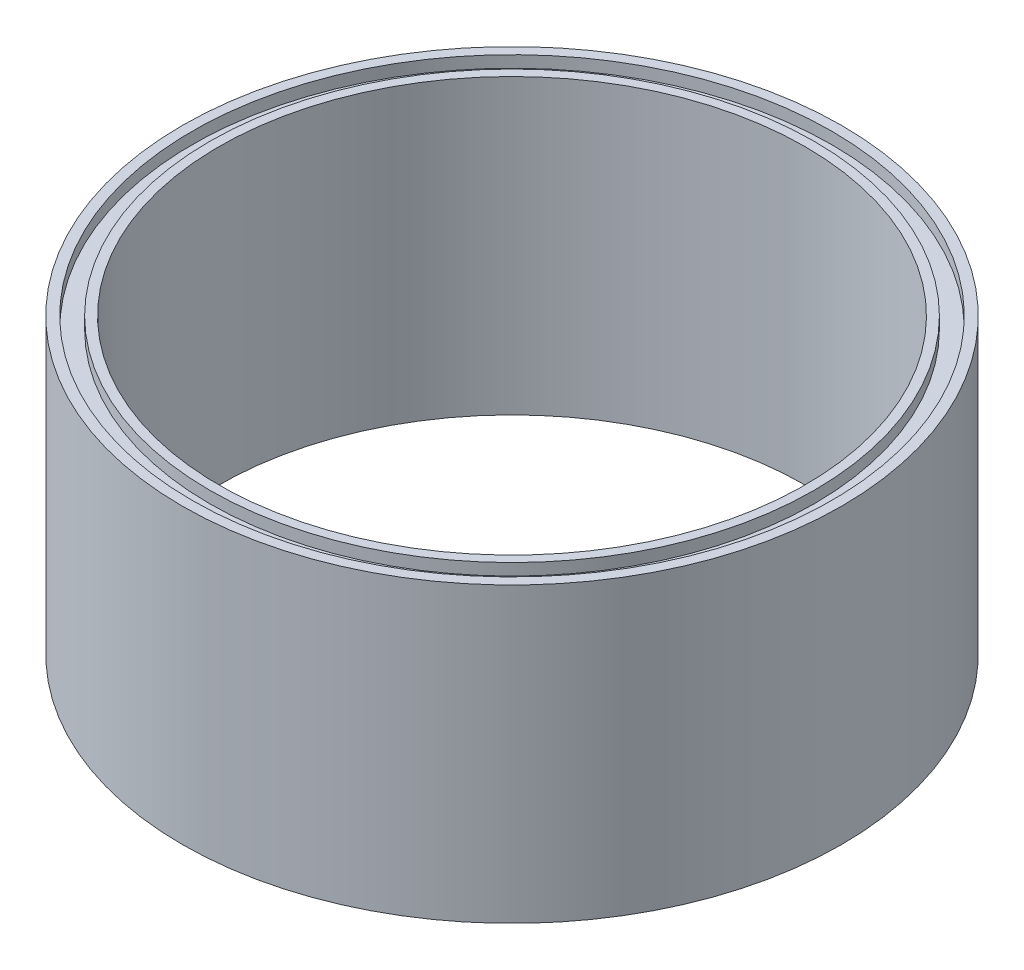
ISO-10303-21;
HEADER;
FILE_DESCRIPTION(('STEP AP214'),'2;1');
FILE_NAME('part.step','',(''),(''),'','','');
FILE_SCHEMA(('AUTOMOTIVE_DESIGN { 1 0 10303 214 1 1 1 1 }'));
ENDSEC;
DATA;
#1=APPLICATION_CONTEXT('core data for automotive mechanical design processes');
#2=APPLICATION_PROTOCOL_DEFINITION('international standard','automotive_design',2000,#1);
#3=PRODUCT_CONTEXT('',#1,'mechanical');
#4=PRODUCT('Part','Part','',(#3));
#5=PRODUCT_RELATED_PRODUCT_CATEGORY('part','',(#4));
#6=PRODUCT_DEFINITION_FORMATION('','',#4);
#7=PRODUCT_DEFINITION_CONTEXT('part definition',#1,'design');
#8=PRODUCT_DEFINITION('design','',#6,#7);
#9=PRODUCT_DEFINITION_SHAPE('','',#8);
#10=(LENGTH_UNIT() NAMED_UNIT(*) SI_UNIT(.MILLI.,.METRE.));
#11=(NAMED_UNIT(*) PLANE_ANGLE_UNIT() SI_UNIT($,.RADIAN.));
#12=(NAMED_UNIT(*) SI_UNIT($,.STERADIAN.) SOLID_ANGLE_UNIT());
#13=UNCERTAINTY_MEASURE_WITH_UNIT(LENGTH_MEASURE(1.E-05),#10,'distance_accuracy_value','');
#14=(GEOMETRIC_REPRESENTATION_CONTEXT(3) GLOBAL_UNCERTAINTY_ASSIGNED_CONTEXT((#13)) GLOBAL_UNIT_ASSIGNED_CONTEXT((#10,
#11,#12)) REPRESENTATION_CONTEXT('',''));
#15=CARTESIAN_POINT('',(0.,0.,0.));
#16=DIRECTION('',(0.,0.,1.));
#17=DIRECTION('',(1.,0.,0.));
#18=AXIS2_PLACEMENT_3D('',#15,#16,#17);
#19=CARTESIAN_POINT('',(-52.3875,0.,0.));
#20=DIRECTION('',(0.,1.,0.));
#21=DIRECTION('',(0.,0.,1.));
#22=AXIS2_PLACEMENT_3D('',#19,#20,#21);
#23=PLANE('',#22);
#24=CARTESIAN_POINT('',(0.,0.,0.));
#25=DIRECTION('',(0.,-1.,0.));
#26=DIRECTION('',(0.,0.,-1.));
#27=AXIS2_PLACEMENT_3D('',#24,#25,#26);
#28=CIRCLE('',#27,50.8);
#29=CARTESIAN_POINT('',(0.,0.,-50.8));
#30=VERTEX_POINT('',#29);
#31=EDGE_CURVE('E10',#30,#30,#28,.T.);
#32=ORIENTED_EDGE('',*,*,#31,.F.);
#33=EDGE_LOOP('',(#32));
#34=FACE_BOUND('',#33,.T.);
#35=CARTESIAN_POINT('',(0.,0.,0.));
#36=DIRECTION('',(0.,-1.,0.));
#37=DIRECTION('',(0.,0.,-1.));
#38=AXIS2_PLACEMENT_3D('',#35,#36,#37);
#39=CIRCLE('',#38,52.3875);
#40=CARTESIAN_POINT('',(0.,0.,-52.3875));
#41=VERTEX_POINT('',#40);
#42=EDGE_CURVE('E88',#41,#41,#39,.T.);
#43=ORIENTED_EDGE('',*,*,#42,.T.);
#44=EDGE_LOOP('',(#43));
#45=FACE_BOUND('',#44,.T.);
#46=ADVANCED_FACE('F37',(#34,#45),#23,.F.);
#47=CARTESIAN_POINT('',(0.,0.,0.));
#48=DIRECTION('',(0.,-1.,0.));
#49=DIRECTION('',(0.,0.,-1.));
#50=AXIS2_PLACEMENT_3D('',#47,#48,#49);
#51=CYLINDRICAL_SURFACE('',#50,50.8);
#52=CARTESIAN_POINT('',(0.,50.8,0.));
#53=DIRECTION('',(0.,-1.,0.));
#54=DIRECTION('',(0.,0.,-1.));
#55=AXIS2_PLACEMENT_3D('',#52,#53,#54);
#56=CIRCLE('',#55,50.8);
#57=CARTESIAN_POINT('',(0.,50.8,-50.8));
#58=VERTEX_POINT('',#57);
#59=EDGE_CURVE('E44',#58,#58,#56,.T.);
#60=ORIENTED_EDGE('',*,*,#59,.F.);
#61=EDGE_LOOP('',(#60));
#62=FACE_BOUND('',#61,.T.);
#63=ORIENTED_EDGE('',*,*,#31,.T.);
#64=EDGE_LOOP('',(#63));
#65=FACE_BOUND('',#64,.T.);
#66=ADVANCED_FACE('F150',(#62,#65),#51,.F.);
#67=CARTESIAN_POINT('',(-50.8,50.8,0.));
#68=DIRECTION('',(0.,-1.,0.));
#69=DIRECTION('',(0.,0.,-1.));
#70=AXIS2_PLACEMENT_3D('',#67,#68,#69);
#71=PLANE('',#70);
#72=CARTESIAN_POINT('',(0.,50.8,0.));
#73=DIRECTION('',(0.,-1.,0.));
#74=DIRECTION('',(0.,0.,-1.));
#75=AXIS2_PLACEMENT_3D('',#72,#73,#74);
#76=CIRCLE('',#75,52.3875);
#77=CARTESIAN_POINT('',(0.,50.8,-52.3875));
#78=VERTEX_POINT('',#77);
#79=EDGE_CURVE('E49',#78,#78,#76,.T.);
#80=ORIENTED_EDGE('',*,*,#79,.F.);
#81=EDGE_LOOP('',(#80));
#82=FACE_BOUND('',#81,.T.);
#83=ORIENTED_EDGE('',*,*,#59,.T.);
#84=EDGE_LOOP('',(#83));
#85=FACE_BOUND('',#84,.T.);
#86=ADVANCED_FACE('F145',(#82,#85),#71,.F.);
#87=CARTESIAN_POINT('',(0.,0.,0.));
#88=DIRECTION('',(0.,-1.,0.));
#89=DIRECTION('',(0.,0.,-1.));
#90=AXIS2_PLACEMENT_3D('',#87,#88,#89);
#91=CYLINDRICAL_SURFACE('',#90,52.3875);
#92=CARTESIAN_POINT('',(0.,48.768,0.));
#93=DIRECTION('',(0.,-1.,0.));
#94=DIRECTION('',(0.,0.,-1.));
#95=AXIS2_PLACEMENT_3D('',#92,#93,#94);
#96=CIRCLE('',#95,52.3875);
#97=CARTESIAN_POINT('',(0.,48.768,-52.3875));
#98=VERTEX_POINT('',#97);
#99=EDGE_CURVE('E54',#98,#98,#96,.T.);
#100=ORIENTED_EDGE('',*,*,#99,.F.);
#101=EDGE_LOOP('',(#100));
#102=FACE_BOUND('',#101,.T.);
#103=ORIENTED_EDGE('',*,*,#79,.T.);
#104=EDGE_LOOP('',(#103));
#105=FACE_BOUND('',#104,.T.);
#106=ADVANCED_FACE('F139',(#102,#105),#91,.T.);
#107=CARTESIAN_POINT('',(-52.3875,48.768,0.));
#108=DIRECTION('',(0.,-1.,0.));
#109=DIRECTION('',(0.,0.,-1.));
#110=AXIS2_PLACEMENT_3D('',#107,#108,#109);
#111=PLANE('',#110);
#112=CARTESIAN_POINT('',(0.,48.768,0.));
#113=DIRECTION('',(0.,-1.,0.));
#114=DIRECTION('',(0.,0.,-1.));
#115=AXIS2_PLACEMENT_3D('',#112,#113,#114);
#116=CIRCLE('',#115,55.4355);
#117=CARTESIAN_POINT('',(0.,48.768,-55.4355));
#118=VERTEX_POINT('',#117);
#119=EDGE_CURVE('E60',#118,#118,#116,.T.);
#120=ORIENTED_EDGE('',*,*,#119,.F.);
#121=EDGE_LOOP('',(#120));
#122=FACE_BOUND('',#121,.T.);
#123=ORIENTED_EDGE('',*,*,#99,.T.);
#124=EDGE_LOOP('',(#123));
#125=FACE_BOUND('',#124,.T.);
#126=ADVANCED_FACE('F133',(#122,#125),#111,.F.);
#127=CARTESIAN_POINT('',(0.,0.,0.));
#128=DIRECTION('',(0.,-1.,0.));
#129=DIRECTION('',(0.,0.,-1.));
#130=AXIS2_PLACEMENT_3D('',#127,#128,#129);
#131=CYLINDRICAL_SURFACE('',#130,55.4355);
#132=CARTESIAN_POINT('',(0.,50.8,0.));
#133=DIRECTION('',(0.,-1.,0.));
#134=DIRECTION('',(0.,0.,-1.));
#135=AXIS2_PLACEMENT_3D('',#132,#133,#134);
#136=CIRCLE('',#135,55.4355);
#137=CARTESIAN_POINT('',(0.,50.8,-55.4355));
#138=VERTEX_POINT('',#137);
#139=EDGE_CURVE('E64',#138,#138,#136,.T.);
#140=ORIENTED_EDGE('',*,*,#139,.F.);
#141=EDGE_LOOP('',(#140));
#142=FACE_BOUND('',#141,.T.);
#143=ORIENTED_EDGE('',*,*,#119,.T.);
#144=EDGE_LOOP('',(#143));
#145=FACE_BOUND('',#144,.T.);
#146=ADVANCED_FACE('F127',(#142,#145),#131,.F.);
#147=CARTESIAN_POINT('',(-55.4355,50.8,0.));
#148=DIRECTION('',(0.,-1.,0.));
#149=DIRECTION('',(0.,0.,-1.));
#150=AXIS2_PLACEMENT_3D('',#147,#148,#149);
#151=PLANE('',#150);
#152=CARTESIAN_POINT('',(0.,50.8,0.));
#153=DIRECTION('',(0.,-1.,0.));
#154=DIRECTION('',(0.,0.,-1.));
#155=AXIS2_PLACEMENT_3D('',#152,#153,#154);
#156=CIRCLE('',#155,57.15);
#157=CARTESIAN_POINT('',(0.,50.8,-57.15));
#158=VERTEX_POINT('',#157);
#159=EDGE_CURVE('E68',#158,#158,#156,.T.);
#160=ORIENTED_EDGE('',*,*,#159,.F.);
#161=EDGE_LOOP('',(#160));
#162=FACE_BOUND('',#161,.T.);
#163=ORIENTED_EDGE('',*,*,#139,.T.);
#164=EDGE_LOOP('',(#163));
#165=FACE_BOUND('',#164,.T.);
#166=ADVANCED_FACE('F121',(#162,#165),#151,.F.);
#167=CARTESIAN_POINT('',(0.,0.,0.));
#168=DIRECTION('',(0.,-1.,0.));
#169=DIRECTION('',(0.,0.,-1.));
#170=AXIS2_PLACEMENT_3D('',#167,#168,#169);
#171=CYLINDRICAL_SURFACE('',#170,57.15);
#172=CARTESIAN_POINT('',(0.,0.,0.));
#173=DIRECTION('',(0.,-1.,0.));
#174=DIRECTION('',(0.,0.,-1.));
#175=AXIS2_PLACEMENT_3D('',#172,#173,#174);
#176=CIRCLE('',#175,57.15);
#177=CARTESIAN_POINT('',(0.,0.,-57.15));
#178=VERTEX_POINT('',#177);
#179=EDGE_CURVE('E72',#178,#178,#176,.T.);
#180=ORIENTED_EDGE('',*,*,#179,.F.);
#181=EDGE_LOOP('',(#180));
#182=FACE_BOUND('',#181,.T.);
#183=ORIENTED_EDGE('',*,*,#159,.T.);
#184=EDGE_LOOP('',(#183));
#185=FACE_BOUND('',#184,.T.);
#186=ADVANCED_FACE('F115',(#182,#185),#171,.T.);
#187=CARTESIAN_POINT('',(-57.15,0.,0.));
#188=DIRECTION('',(0.,1.,0.));
#189=DIRECTION('',(0.,0.,1.));
#190=AXIS2_PLACEMENT_3D('',#187,#188,#189);
#191=PLANE('',#190);
#192=CARTESIAN_POINT('',(0.,0.,0.));
#193=DIRECTION('',(0.,-1.,0.));
#194=DIRECTION('',(0.,0.,-1.));
#195=AXIS2_PLACEMENT_3D('',#192,#193,#194);
#196=CIRCLE('',#195,55.4355);
#197=CARTESIAN_POINT('',(0.,0.,-55.4355));
#198=VERTEX_POINT('',#197);
#199=EDGE_CURVE('E76',#198,#198,#196,.T.);
#200=ORIENTED_EDGE('',*,*,#199,.F.);
#201=EDGE_LOOP('',(#200));
#202=FACE_BOUND('',#201,.T.);
#203=ORIENTED_EDGE('',*,*,#179,.T.);
#204=EDGE_LOOP('',(#203));
#205=FACE_BOUND('',#204,.T.);
#206=ADVANCED_FACE('F109',(#202,#205),#191,.F.);
#207=CARTESIAN_POINT('',(0.,0.,0.));
#208=DIRECTION('',(0.,-1.,0.));
#209=DIRECTION('',(0.,0.,-1.));
#210=AXIS2_PLACEMENT_3D('',#207,#208,#209);
#211=CYLINDRICAL_SURFACE('',#210,55.4355);
#212=CARTESIAN_POINT('',(0.,2.032,0.));
#213=DIRECTION('',(0.,-1.,0.));
#214=DIRECTION('',(0.,0.,-1.));
#215=AXIS2_PLACEMENT_3D('',#212,#213,#214);
#216=CIRCLE('',#215,55.4355);
#217=CARTESIAN_POINT('',(0.,2.032,-55.4355));
#218=VERTEX_POINT('',#217);
#219=EDGE_CURVE('E80',#218,#218,#216,.T.);
#220=ORIENTED_EDGE('',*,*,#219,.F.);
#221=EDGE_LOOP('',(#220));
#222=FACE_BOUND('',#221,.T.);
#223=ORIENTED_EDGE('',*,*,#199,.T.);
#224=EDGE_LOOP('',(#223));
#225=FACE_BOUND('',#224,.T.);
#226=ADVANCED_FACE('F103',(#222,#225),#211,.F.);
#227=CARTESIAN_POINT('',(-55.4355,2.032,0.));
#228=DIRECTION('',(0.,1.,0.));
#229=DIRECTION('',(0.,0.,1.));
#230=AXIS2_PLACEMENT_3D('',#227,#228,#229);
#231=PLANE('',#230);
#232=CARTESIAN_POINT('',(0.,2.032,0.));
#233=DIRECTION('',(0.,-1.,0.));
#234=DIRECTION('',(0.,0.,-1.));
#235=AXIS2_PLACEMENT_3D('',#232,#233,#234);
#236=CIRCLE('',#235,52.3875);
#237=CARTESIAN_POINT('',(0.,2.032,-52.3875));
#238=VERTEX_POINT('',#237);
#239=EDGE_CURVE('E84',#238,#238,#236,.T.);
#240=ORIENTED_EDGE('',*,*,#239,.F.);
#241=EDGE_LOOP('',(#240));
#242=FACE_BOUND('',#241,.T.);
#243=ORIENTED_EDGE('',*,*,#219,.T.);
#244=EDGE_LOOP('',(#243));
#245=FACE_BOUND('',#244,.T.);
#246=ADVANCED_FACE('F97',(#242,#245),#231,.F.);
#247=CARTESIAN_POINT('',(0.,0.,0.));
#248=DIRECTION('',(0.,-1.,0.));
#249=DIRECTION('',(0.,0.,-1.));
#250=AXIS2_PLACEMENT_3D('',#247,#248,#249);
#251=CYLINDRICAL_SURFACE('',#250,52.3875);
#252=ORIENTED_EDGE('',*,*,#42,.F.);
#253=EDGE_LOOP('',(#252));
#254=FACE_BOUND('',#253,.T.);
#255=ORIENTED_EDGE('',*,*,#239,.T.);
#256=EDGE_LOOP('',(#255));
#257=FACE_BOUND('',#256,.T.);
#258=ADVANCED_FACE('F94',(#254,#257),#251,.T.);
#259=CLOSED_SHELL('',(#46,#66,#86,#106,#126,#146,#166,#186,#206,#226,#246,#258));
#260=MANIFOLD_SOLID_BREP('B2',#259);
#261=ADVANCED_BREP_SHAPE_REPRESENTATION('',(#18,#260),#14);
#262=SHAPE_DEFINITION_REPRESENTATION(#9,#261);
ENDSEC;
END-ISO-10303-21;
